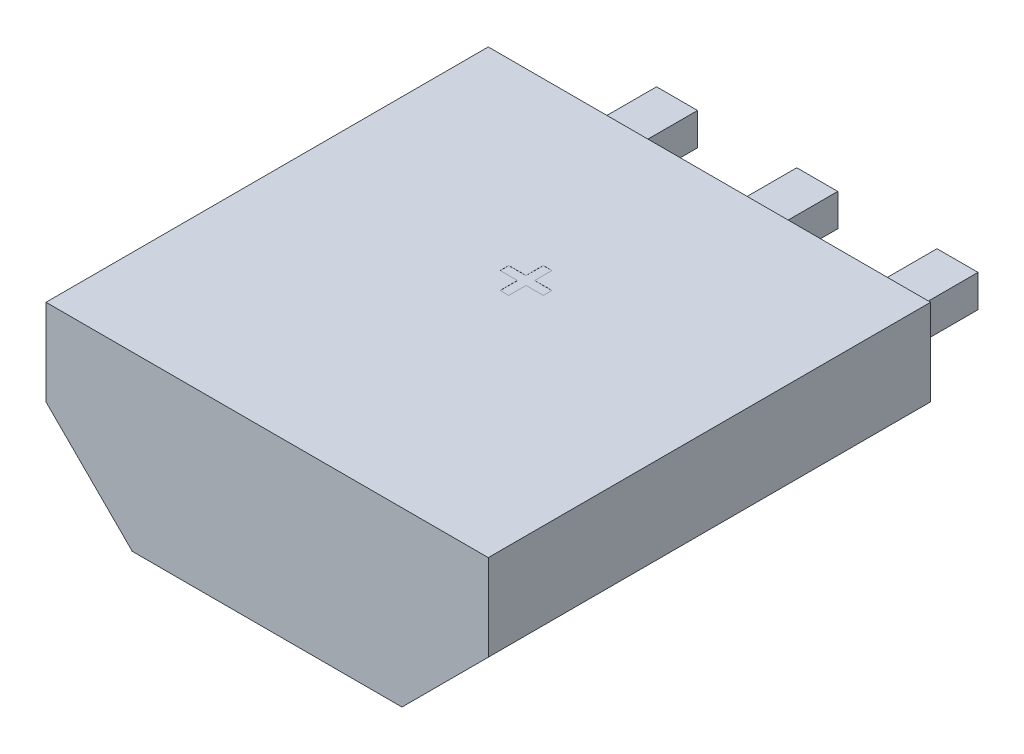
ISO-10303-21;
HEADER;
FILE_DESCRIPTION(('STEP AP214'),'2;1');
FILE_NAME('part.step','',(''),(''),'','','');
FILE_SCHEMA(('AUTOMOTIVE_DESIGN { 1 0 10303 214 1 1 1 1 }'));
ENDSEC;
DATA;
#1=APPLICATION_CONTEXT('core data for automotive mechanical design processes');
#2=APPLICATION_PROTOCOL_DEFINITION('international standard','automotive_design',2000,#1);
#3=PRODUCT_CONTEXT('',#1,'mechanical');
#4=PRODUCT('Part','Part','',(#3));
#5=PRODUCT_RELATED_PRODUCT_CATEGORY('part','',(#4));
#6=PRODUCT_DEFINITION_FORMATION('','',#4);
#7=PRODUCT_DEFINITION_CONTEXT('part definition',#1,'design');
#8=PRODUCT_DEFINITION('design','',#6,#7);
#9=PRODUCT_DEFINITION_SHAPE('','',#8);
#10=(LENGTH_UNIT() NAMED_UNIT(*) SI_UNIT(.MILLI.,.METRE.));
#11=(NAMED_UNIT(*) PLANE_ANGLE_UNIT() SI_UNIT($,.RADIAN.));
#12=(NAMED_UNIT(*) SI_UNIT($,.STERADIAN.) SOLID_ANGLE_UNIT());
#13=UNCERTAINTY_MEASURE_WITH_UNIT(LENGTH_MEASURE(1.E-05),#10,'distance_accuracy_value','');
#14=(GEOMETRIC_REPRESENTATION_CONTEXT(3) GLOBAL_UNCERTAINTY_ASSIGNED_CONTEXT((#13)) GLOBAL_UNIT_ASSIGNED_CONTEXT((#10,
#11,#12)) REPRESENTATION_CONTEXT('',''));
#15=CARTESIAN_POINT('',(0.,0.,0.));
#16=DIRECTION('',(0.,0.,1.));
#17=DIRECTION('',(1.,0.,0.));
#18=AXIS2_PLACEMENT_3D('',#15,#16,#17);
#19=CARTESIAN_POINT('',(-2.05,-1.6,0.));
#20=DIRECTION('',(0.,0.,1.));
#21=DIRECTION('',(1.,0.,0.));
#22=AXIS2_PLACEMENT_3D('',#19,#20,#21);
#23=PLANE('',#22);
#24=DIRECTION('',(0.,-1.,0.));
#25=VECTOR('',#24,1.);
#26=CARTESIAN_POINT('',(1.49,-0.84,0.));
#27=LINE('',#26,#25);
#28=CARTESIAN_POINT('',(1.49,-0.54,0.));
#29=VERTEX_POINT('',#28);
#30=CARTESIAN_POINT('',(1.49,-0.84,0.));
#31=VERTEX_POINT('',#30);
#32=EDGE_CURVE('E371',#29,#31,#27,.T.);
#33=ORIENTED_EDGE('',*,*,#32,.F.);
#34=DIRECTION('',(1.,0.,0.));
#35=VECTOR('',#34,1.);
#36=CARTESIAN_POINT('',(1.49,-0.54,0.));
#37=LINE('',#36,#35);
#38=CARTESIAN_POINT('',(1.11,-0.54,0.));
#39=VERTEX_POINT('',#38);
#40=EDGE_CURVE('E376',#39,#29,#37,.T.);
#41=ORIENTED_EDGE('',*,*,#40,.F.);
#42=DIRECTION('',(0.,1.,0.));
#43=VECTOR('',#42,1.);
#44=CARTESIAN_POINT('',(1.11,-0.54,0.));
#45=LINE('',#44,#43);
#46=CARTESIAN_POINT('',(1.11,-0.84,0.));
#47=VERTEX_POINT('',#46);
#48=EDGE_CURVE('E388',#47,#39,#45,.T.);
#49=ORIENTED_EDGE('',*,*,#48,.F.);
#50=DIRECTION('',(-1.,0.,0.));
#51=VECTOR('',#50,1.);
#52=CARTESIAN_POINT('',(1.11,-0.84,0.));
#53=LINE('',#52,#51);
#54=EDGE_CURVE('E385',#31,#47,#53,.T.);
#55=ORIENTED_EDGE('',*,*,#54,.F.);
#56=EDGE_LOOP('',(#33,#41,#49,#55));
#57=FACE_BOUND('',#56,.T.);
#58=DIRECTION('',(0.,-1.,0.));
#59=VECTOR('',#58,1.);
#60=CARTESIAN_POINT('',(-2.05,0.,0.));
#61=LINE('',#60,#59);
#62=CARTESIAN_POINT('',(-2.05,0.,0.));
#63=VERTEX_POINT('',#62);
#64=CARTESIAN_POINT('',(-2.05,-0.8,0.));
#65=VERTEX_POINT('',#64);
#66=EDGE_CURVE('E438',#63,#65,#61,.T.);
#67=ORIENTED_EDGE('',*,*,#66,.F.);
#68=DIRECTION('',(-1.,0.,0.));
#69=VECTOR('',#68,1.);
#70=CARTESIAN_POINT('',(2.05,0.,0.));
#71=LINE('',#70,#69);
#72=CARTESIAN_POINT('',(2.05,0.,0.));
#73=VERTEX_POINT('',#72);
#74=EDGE_CURVE('E454',#73,#63,#71,.T.);
#75=ORIENTED_EDGE('',*,*,#74,.F.);
#76=DIRECTION('',(0.,1.,0.));
#77=VECTOR('',#76,1.);
#78=CARTESIAN_POINT('',(2.05,-0.800000000000001,0.));
#79=LINE('',#78,#77);
#80=CARTESIAN_POINT('',(2.05,-0.800000000000001,0.));
#81=VERTEX_POINT('',#80);
#82=EDGE_CURVE('E451',#81,#73,#79,.T.);
#83=ORIENTED_EDGE('',*,*,#82,.F.);
#84=DIRECTION('',(0.707106781186547,0.707106781186548,0.));
#85=VECTOR('',#84,1.);
#86=CARTESIAN_POINT('',(1.25,-1.6,0.));
#87=LINE('',#86,#85);
#88=CARTESIAN_POINT('',(1.25,-1.6,0.));
#89=VERTEX_POINT('',#88);
#90=EDGE_CURVE('E448',#89,#81,#87,.T.);
#91=ORIENTED_EDGE('',*,*,#90,.F.);
#92=DIRECTION('',(1.,0.,0.));
#93=VECTOR('',#92,1.);
#94=CARTESIAN_POINT('',(-1.25,-1.6,0.));
#95=LINE('',#94,#93);
#96=CARTESIAN_POINT('',(-1.25,-1.6,0.));
#97=VERTEX_POINT('',#96);
#98=EDGE_CURVE('E445',#97,#89,#95,.T.);
#99=ORIENTED_EDGE('',*,*,#98,.F.);
#100=DIRECTION('',(0.707106781186548,-0.707106781186547,0.));
#101=VECTOR('',#100,1.);
#102=CARTESIAN_POINT('',(-2.05,-0.8,0.));
#103=LINE('',#102,#101);
#104=EDGE_CURVE('E441',#65,#97,#103,.T.);
#105=ORIENTED_EDGE('',*,*,#104,.F.);
#106=EDGE_LOOP('',(#67,#75,#83,#91,#99,#105));
#107=FACE_BOUND('',#106,.T.);
#108=DIRECTION('',(0.,-1.,0.));
#109=VECTOR('',#108,1.);
#110=CARTESIAN_POINT('',(0.19,-0.84,0.));
#111=LINE('',#110,#109);
#112=CARTESIAN_POINT('',(0.19,-0.54,0.));
#113=VERTEX_POINT('',#112);
#114=CARTESIAN_POINT('',(0.19,-0.84,0.));
#115=VERTEX_POINT('',#114);
#116=EDGE_CURVE('E404',#113,#115,#111,.T.);
#117=ORIENTED_EDGE('',*,*,#116,.F.);
#118=DIRECTION('',(1.,0.,0.));
#119=VECTOR('',#118,1.);
#120=CARTESIAN_POINT('',(0.19,-0.54,0.));
#121=LINE('',#120,#119);
#122=CARTESIAN_POINT('',(-0.19,-0.54,0.));
#123=VERTEX_POINT('',#122);
#124=EDGE_CURVE('E409',#123,#113,#121,.T.);
#125=ORIENTED_EDGE('',*,*,#124,.F.);
#126=DIRECTION('',(0.,1.,0.));
#127=VECTOR('',#126,1.);
#128=CARTESIAN_POINT('',(-0.19,-0.54,0.));
#129=LINE('',#128,#127);
#130=CARTESIAN_POINT('',(-0.19,-0.84,0.));
#131=VERTEX_POINT('',#130);
#132=EDGE_CURVE('E421',#131,#123,#129,.T.);
#133=ORIENTED_EDGE('',*,*,#132,.F.);
#134=DIRECTION('',(-1.,0.,0.));
#135=VECTOR('',#134,1.);
#136=CARTESIAN_POINT('',(-0.19,-0.84,0.));
#137=LINE('',#136,#135);
#138=EDGE_CURVE('E418',#115,#131,#137,.T.);
#139=ORIENTED_EDGE('',*,*,#138,.F.);
#140=EDGE_LOOP('',(#117,#125,#133,#139));
#141=FACE_BOUND('',#140,.T.);
#142=DIRECTION('',(0.,-1.,0.));
#143=VECTOR('',#142,1.);
#144=CARTESIAN_POINT('',(-1.11,-0.84,0.));
#145=LINE('',#144,#143);
#146=CARTESIAN_POINT('',(-1.11,-0.54,0.));
#147=VERTEX_POINT('',#146);
#148=CARTESIAN_POINT('',(-1.11,-0.84,0.));
#149=VERTEX_POINT('',#148);
#150=EDGE_CURVE('E339',#147,#149,#145,.T.);
#151=ORIENTED_EDGE('',*,*,#150,.F.);
#152=DIRECTION('',(1.,0.,0.));
#153=VECTOR('',#152,1.);
#154=CARTESIAN_POINT('',(-1.11,-0.54,0.));
#155=LINE('',#154,#153);
#156=CARTESIAN_POINT('',(-1.49,-0.54,0.));
#157=VERTEX_POINT('',#156);
#158=EDGE_CURVE('E346',#157,#147,#155,.T.);
#159=ORIENTED_EDGE('',*,*,#158,.F.);
#160=DIRECTION('',(0.,1.,0.));
#161=VECTOR('',#160,1.);
#162=CARTESIAN_POINT('',(-1.49,-0.54,0.));
#163=LINE('',#162,#161);
#164=CARTESIAN_POINT('',(-1.49,-0.84,0.));
#165=VERTEX_POINT('',#164);
#166=EDGE_CURVE('E356',#165,#157,#163,.T.);
#167=ORIENTED_EDGE('',*,*,#166,.F.);
#168=DIRECTION('',(-1.,0.,0.));
#169=VECTOR('',#168,1.);
#170=CARTESIAN_POINT('',(-1.49,-0.84,0.));
#171=LINE('',#170,#169);
#172=EDGE_CURVE('E60',#149,#165,#171,.T.);
#173=ORIENTED_EDGE('',*,*,#172,.F.);
#174=EDGE_LOOP('',(#151,#159,#167,#173));
#175=FACE_BOUND('',#174,.T.);
#176=ADVANCED_FACE('F35',(#57,#107,#141,#175),#23,.F.);
#177=CARTESIAN_POINT('',(-2.05,0.,0.));
#178=DIRECTION('',(-1.,0.,0.));
#179=DIRECTION('',(0.,-1.,0.));
#180=AXIS2_PLACEMENT_3D('',#177,#178,#179);
#181=PLANE('',#180);
#182=DIRECTION('',(0.,-1.,0.));
#183=VECTOR('',#182,1.);
#184=CARTESIAN_POINT('',(-2.05,0.,4.1));
#185=LINE('',#184,#183);
#186=CARTESIAN_POINT('',(-2.05,0.,4.1));
#187=VERTEX_POINT('',#186);
#188=CARTESIAN_POINT('',(-2.05,-0.8,4.1));
#189=VERTEX_POINT('',#188);
#190=EDGE_CURVE('E437',#187,#189,#185,.T.);
#191=ORIENTED_EDGE('',*,*,#190,.F.);
#192=DIRECTION('',(0.,0.,1.));
#193=VECTOR('',#192,1.);
#194=CARTESIAN_POINT('',(-2.05,0.,0.));
#195=LINE('',#194,#193);
#196=EDGE_CURVE('E11',#63,#187,#195,.T.);
#197=ORIENTED_EDGE('',*,*,#196,.F.);
#198=ORIENTED_EDGE('',*,*,#66,.T.);
#199=DIRECTION('',(0.,0.,1.));
#200=VECTOR('',#199,1.);
#201=CARTESIAN_POINT('',(-2.05,-0.8,0.));
#202=LINE('',#201,#200);
#203=EDGE_CURVE('E39',#65,#189,#202,.T.);
#204=ORIENTED_EDGE('',*,*,#203,.T.);
#205=EDGE_LOOP('',(#191,#197,#198,#204));
#206=FACE_BOUND('',#205,.T.);
#207=ADVANCED_FACE('F37',(#206),#181,.T.);
#208=CARTESIAN_POINT('',(2.05,0.,0.));
#209=DIRECTION('',(0.,1.,0.));
#210=DIRECTION('',(0.,0.,1.));
#211=AXIS2_PLACEMENT_3D('',#208,#209,#210);
#212=PLANE('',#211);
#213=DIRECTION('',(0.,0.,1.));
#214=VECTOR('',#213,1.);
#215=CARTESIAN_POINT('',(-0.2,0.,1.66));
#216=LINE('',#215,#214);
#217=CARTESIAN_POINT('',(-0.2,0.,1.66));
#218=VERTEX_POINT('',#217);
#219=CARTESIAN_POINT('',(-0.2,0.,1.74));
#220=VERTEX_POINT('',#219);
#221=EDGE_CURVE('E52',#218,#220,#216,.T.);
#222=ORIENTED_EDGE('',*,*,#221,.F.);
#223=DIRECTION('',(-1.,0.,0.));
#224=VECTOR('',#223,1.);
#225=CARTESIAN_POINT('',(-0.2,0.,1.66));
#226=LINE('',#225,#224);
#227=CARTESIAN_POINT('',(-0.0399999999999998,0.,1.66));
#228=VERTEX_POINT('',#227);
#229=EDGE_CURVE('E254',#228,#218,#226,.T.);
#230=ORIENTED_EDGE('',*,*,#229,.F.);
#231=DIRECTION('',(0.,0.,1.));
#232=VECTOR('',#231,1.);
#233=CARTESIAN_POINT('',(-0.0399999999999998,0.,1.5));
#234=LINE('',#233,#232);
#235=CARTESIAN_POINT('',(-0.0399999999999998,0.,1.5));
#236=VERTEX_POINT('',#235);
#237=EDGE_CURVE('E257',#236,#228,#234,.T.);
#238=ORIENTED_EDGE('',*,*,#237,.F.);
#239=DIRECTION('',(-1.,0.,0.));
#240=VECTOR('',#239,1.);
#241=CARTESIAN_POINT('',(-0.0399999999999998,0.,1.5));
#242=LINE('',#241,#240);
#243=CARTESIAN_POINT('',(0.0400000000000002,0.,1.5));
#244=VERTEX_POINT('',#243);
#245=EDGE_CURVE('E309',#244,#236,#242,.T.);
#246=ORIENTED_EDGE('',*,*,#245,.F.);
#247=DIRECTION('',(0.,0.,-1.));
#248=VECTOR('',#247,1.);
#249=CARTESIAN_POINT('',(0.0400000000000002,0.,1.5));
#250=LINE('',#249,#248);
#251=CARTESIAN_POINT('',(0.0400000000000002,0.,1.66));
#252=VERTEX_POINT('',#251);
#253=EDGE_CURVE('E306',#252,#244,#250,.T.);
#254=ORIENTED_EDGE('',*,*,#253,.F.);
#255=DIRECTION('',(-1.,0.,0.));
#256=VECTOR('',#255,1.);
#257=CARTESIAN_POINT('',(0.2,0.,1.66));
#258=LINE('',#257,#256);
#259=CARTESIAN_POINT('',(0.2,0.,1.66));
#260=VERTEX_POINT('',#259);
#261=EDGE_CURVE('E303',#260,#252,#258,.T.);
#262=ORIENTED_EDGE('',*,*,#261,.F.);
#263=DIRECTION('',(0.,0.,-1.));
#264=VECTOR('',#263,1.);
#265=CARTESIAN_POINT('',(0.2,0.,1.66));
#266=LINE('',#265,#264);
#267=CARTESIAN_POINT('',(0.2,0.,1.74));
#268=VERTEX_POINT('',#267);
#269=EDGE_CURVE('E300',#268,#260,#266,.T.);
#270=ORIENTED_EDGE('',*,*,#269,.F.);
#271=DIRECTION('',(1.,0.,0.));
#272=VECTOR('',#271,1.);
#273=CARTESIAN_POINT('',(0.2,0.,1.74));
#274=LINE('',#273,#272);
#275=CARTESIAN_POINT('',(0.0400000000000002,0.,1.74));
#276=VERTEX_POINT('',#275);
#277=EDGE_CURVE('E297',#276,#268,#274,.T.);
#278=ORIENTED_EDGE('',*,*,#277,.F.);
#279=DIRECTION('',(0.,0.,-1.));
#280=VECTOR('',#279,1.);
#281=CARTESIAN_POINT('',(0.0400000000000002,0.,1.9));
#282=LINE('',#281,#280);
#283=CARTESIAN_POINT('',(0.0400000000000002,0.,1.9));
#284=VERTEX_POINT('',#283);
#285=EDGE_CURVE('E294',#284,#276,#282,.T.);
#286=ORIENTED_EDGE('',*,*,#285,.F.);
#287=DIRECTION('',(1.,0.,0.));
#288=VECTOR('',#287,1.);
#289=CARTESIAN_POINT('',(-0.0399999999999997,0.,1.9));
#290=LINE('',#289,#288);
#291=CARTESIAN_POINT('',(-0.0399999999999997,0.,1.9));
#292=VERTEX_POINT('',#291);
#293=EDGE_CURVE('E291',#292,#284,#290,.T.);
#294=ORIENTED_EDGE('',*,*,#293,.F.);
#295=DIRECTION('',(0.,0.,1.));
#296=VECTOR('',#295,1.);
#297=CARTESIAN_POINT('',(-0.0399999999999997,0.,1.9));
#298=LINE('',#297,#296);
#299=CARTESIAN_POINT('',(-0.0399999999999998,0.,1.74));
#300=VERTEX_POINT('',#299);
#301=EDGE_CURVE('E288',#300,#292,#298,.T.);
#302=ORIENTED_EDGE('',*,*,#301,.F.);
#303=DIRECTION('',(1.,0.,0.));
#304=VECTOR('',#303,1.);
#305=CARTESIAN_POINT('',(-0.2,0.,1.74));
#306=LINE('',#305,#304);
#307=EDGE_CURVE('E286',#220,#300,#306,.T.);
#308=ORIENTED_EDGE('',*,*,#307,.F.);
#309=EDGE_LOOP('',(#222,#230,#238,#246,#254,#262,#270,#278,#286,#294,#302,#308));
#310=FACE_BOUND('',#309,.T.);
#311=DIRECTION('',(-1.,0.,0.));
#312=VECTOR('',#311,1.);
#313=CARTESIAN_POINT('',(2.05,0.,4.1));
#314=LINE('',#313,#312);
#315=CARTESIAN_POINT('',(2.05,0.,4.1));
#316=VERTEX_POINT('',#315);
#317=EDGE_CURVE('E442',#316,#187,#314,.T.);
#318=ORIENTED_EDGE('',*,*,#317,.F.);
#319=DIRECTION('',(0.,0.,1.));
#320=VECTOR('',#319,1.);
#321=CARTESIAN_POINT('',(2.05,0.,0.));
#322=LINE('',#321,#320);
#323=EDGE_CURVE('E44',#73,#316,#322,.T.);
#324=ORIENTED_EDGE('',*,*,#323,.F.);
#325=ORIENTED_EDGE('',*,*,#74,.T.);
#326=ORIENTED_EDGE('',*,*,#196,.T.);
#327=EDGE_LOOP('',(#318,#324,#325,#326));
#328=FACE_BOUND('',#327,.T.);
#329=ADVANCED_FACE('F491',(#310,#328),#212,.T.);
#330=CARTESIAN_POINT('',(2.05,-0.800000000000001,0.));
#331=DIRECTION('',(1.,0.,0.));
#332=DIRECTION('',(0.,1.,0.));
#333=AXIS2_PLACEMENT_3D('',#330,#331,#332);
#334=PLANE('',#333);
#335=DIRECTION('',(0.,1.,0.));
#336=VECTOR('',#335,1.);
#337=CARTESIAN_POINT('',(2.05,-0.800000000000001,4.1));
#338=LINE('',#337,#336);
#339=CARTESIAN_POINT('',(2.05,-0.800000000000001,4.1));
#340=VERTEX_POINT('',#339);
#341=EDGE_CURVE('E468',#340,#316,#338,.T.);
#342=ORIENTED_EDGE('',*,*,#341,.F.);
#343=DIRECTION('',(0.,0.,1.));
#344=VECTOR('',#343,1.);
#345=CARTESIAN_POINT('',(2.05,-0.800000000000001,0.));
#346=LINE('',#345,#344);
#347=EDGE_CURVE('E474',#81,#340,#346,.T.);
#348=ORIENTED_EDGE('',*,*,#347,.F.);
#349=ORIENTED_EDGE('',*,*,#82,.T.);
#350=ORIENTED_EDGE('',*,*,#323,.T.);
#351=EDGE_LOOP('',(#342,#348,#349,#350));
#352=FACE_BOUND('',#351,.T.);
#353=ADVANCED_FACE('F504',(#352),#334,.T.);
#354=CARTESIAN_POINT('',(1.25,-1.6,0.));
#355=DIRECTION('',(0.707106781186548,-0.707106781186547,0.));
#356=DIRECTION('',(0.707106781186547,0.707106781186548,0.));
#357=AXIS2_PLACEMENT_3D('',#354,#355,#356);
#358=PLANE('',#357);
#359=DIRECTION('',(0.707106781186547,0.707106781186548,0.));
#360=VECTOR('',#359,1.);
#361=CARTESIAN_POINT('',(1.25,-1.6,4.1));
#362=LINE('',#361,#360);
#363=CARTESIAN_POINT('',(1.25,-1.6,4.1));
#364=VERTEX_POINT('',#363);
#365=EDGE_CURVE('E465',#364,#340,#362,.T.);
#366=ORIENTED_EDGE('',*,*,#365,.F.);
#367=DIRECTION('',(0.,0.,1.));
#368=VECTOR('',#367,1.);
#369=CARTESIAN_POINT('',(1.25,-1.6,0.));
#370=LINE('',#369,#368);
#371=EDGE_CURVE('E476',#89,#364,#370,.T.);
#372=ORIENTED_EDGE('',*,*,#371,.F.);
#373=ORIENTED_EDGE('',*,*,#90,.T.);
#374=ORIENTED_EDGE('',*,*,#347,.T.);
#375=EDGE_LOOP('',(#366,#372,#373,#374));
#376=FACE_BOUND('',#375,.T.);
#377=ADVANCED_FACE('F502',(#376),#358,.T.);
#378=CARTESIAN_POINT('',(-1.25,-1.6,0.));
#379=DIRECTION('',(0.,-1.,0.));
#380=DIRECTION('',(1.,0.,0.));
#381=AXIS2_PLACEMENT_3D('',#378,#379,#380);
#382=PLANE('',#381);
#383=CARTESIAN_POINT('',(0.,-1.6,1.7));
#384=DIRECTION('',(0.,-1.,0.));
#385=DIRECTION('',(1.,0.,0.));
#386=AXIS2_PLACEMENT_3D('',#383,#384,#385);
#387=CIRCLE('',#386,0.2);
#388=CARTESIAN_POINT('',(0.2,-1.6,1.7));
#389=VERTEX_POINT('',#388);
#390=EDGE_CURVE('E316',#389,#389,#387,.T.);
#391=ORIENTED_EDGE('',*,*,#390,.F.);
#392=EDGE_LOOP('',(#391));
#393=FACE_BOUND('',#392,.T.);
#394=DIRECTION('',(1.,0.,0.));
#395=VECTOR('',#394,1.);
#396=CARTESIAN_POINT('',(-1.25,-1.6,4.1));
#397=LINE('',#396,#395);
#398=CARTESIAN_POINT('',(-1.25,-1.6,4.1));
#399=VERTEX_POINT('',#398);
#400=EDGE_CURVE('E462',#399,#364,#397,.T.);
#401=ORIENTED_EDGE('',*,*,#400,.F.);
#402=DIRECTION('',(0.,0.,1.));
#403=VECTOR('',#402,1.);
#404=CARTESIAN_POINT('',(-1.25,-1.6,0.));
#405=LINE('',#404,#403);
#406=EDGE_CURVE('E477',#97,#399,#405,.T.);
#407=ORIENTED_EDGE('',*,*,#406,.F.);
#408=ORIENTED_EDGE('',*,*,#98,.T.);
#409=ORIENTED_EDGE('',*,*,#371,.T.);
#410=EDGE_LOOP('',(#401,#407,#408,#409));
#411=FACE_BOUND('',#410,.T.);
#412=ADVANCED_FACE('F499',(#393,#411),#382,.T.);
#413=CARTESIAN_POINT('',(-2.05,-0.8,0.));
#414=DIRECTION('',(-0.707106781186547,-0.707106781186548,0.));
#415=DIRECTION('',(0.707106781186548,-0.707106781186547,0.));
#416=AXIS2_PLACEMENT_3D('',#413,#414,#415);
#417=PLANE('',#416);
#418=DIRECTION('',(0.707106781186548,-0.707106781186547,0.));
#419=VECTOR('',#418,1.);
#420=CARTESIAN_POINT('',(-2.05,-0.8,4.1));
#421=LINE('',#420,#419);
#422=EDGE_CURVE('E459',#189,#399,#421,.T.);
#423=ORIENTED_EDGE('',*,*,#422,.F.);
#424=ORIENTED_EDGE('',*,*,#203,.F.);
#425=ORIENTED_EDGE('',*,*,#104,.T.);
#426=ORIENTED_EDGE('',*,*,#406,.T.);
#427=EDGE_LOOP('',(#423,#424,#425,#426));
#428=FACE_BOUND('',#427,.T.);
#429=ADVANCED_FACE('F485',(#428),#417,.T.);
#430=CARTESIAN_POINT('',(-2.05,-1.6,4.1));
#431=DIRECTION('',(0.,0.,1.));
#432=DIRECTION('',(1.,0.,0.));
#433=AXIS2_PLACEMENT_3D('',#430,#431,#432);
#434=PLANE('',#433);
#435=ORIENTED_EDGE('',*,*,#190,.T.);
#436=ORIENTED_EDGE('',*,*,#422,.T.);
#437=ORIENTED_EDGE('',*,*,#400,.T.);
#438=ORIENTED_EDGE('',*,*,#365,.T.);
#439=ORIENTED_EDGE('',*,*,#341,.T.);
#440=ORIENTED_EDGE('',*,*,#317,.T.);
#441=EDGE_LOOP('',(#435,#436,#437,#438,#439,#440));
#442=FACE_BOUND('',#441,.T.);
#443=ADVANCED_FACE('F487',(#442),#434,.T.);
#444=CARTESIAN_POINT('',(0.19,-0.84,-1.));
#445=DIRECTION('',(-1.,0.,0.));
#446=DIRECTION('',(0.,-1.,0.));
#447=AXIS2_PLACEMENT_3D('',#444,#445,#446);
#448=PLANE('',#447);
#449=ORIENTED_EDGE('',*,*,#116,.T.);
#450=DIRECTION('',(0.,0.,1.));
#451=VECTOR('',#450,1.);
#452=CARTESIAN_POINT('',(0.19,-0.84,-1.));
#453=LINE('',#452,#451);
#454=CARTESIAN_POINT('',(0.19,-0.84,-1.));
#455=VERTEX_POINT('',#454);
#456=EDGE_CURVE('E434',#455,#115,#453,.T.);
#457=ORIENTED_EDGE('',*,*,#456,.F.);
#458=DIRECTION('',(0.,-1.,0.));
#459=VECTOR('',#458,1.);
#460=CARTESIAN_POINT('',(0.19,-0.84,-1.));
#461=LINE('',#460,#459);
#462=CARTESIAN_POINT('',(0.19,-0.54,-1.));
#463=VERTEX_POINT('',#462);
#464=EDGE_CURVE('E405',#463,#455,#461,.T.);
#465=ORIENTED_EDGE('',*,*,#464,.F.);
#466=DIRECTION('',(0.,0.,1.));
#467=VECTOR('',#466,1.);
#468=CARTESIAN_POINT('',(0.19,-0.54,-1.));
#469=LINE('',#468,#467);
#470=EDGE_CURVE('E415',#463,#113,#469,.T.);
#471=ORIENTED_EDGE('',*,*,#470,.T.);
#472=EDGE_LOOP('',(#449,#457,#465,#471));
#473=FACE_BOUND('',#472,.T.);
#474=ADVANCED_FACE('F522',(#473),#448,.F.);
#475=CARTESIAN_POINT('',(-0.19,-0.84,-1.));
#476=DIRECTION('',(0.,1.,0.));
#477=DIRECTION('',(0.,0.,1.));
#478=AXIS2_PLACEMENT_3D('',#475,#476,#477);
#479=PLANE('',#478);
#480=ORIENTED_EDGE('',*,*,#138,.T.);
#481=DIRECTION('',(0.,0.,1.));
#482=VECTOR('',#481,1.);
#483=CARTESIAN_POINT('',(-0.19,-0.84,-1.));
#484=LINE('',#483,#482);
#485=CARTESIAN_POINT('',(-0.19,-0.84,-1.));
#486=VERTEX_POINT('',#485);
#487=EDGE_CURVE('E431',#486,#131,#484,.T.);
#488=ORIENTED_EDGE('',*,*,#487,.F.);
#489=DIRECTION('',(-1.,0.,0.));
#490=VECTOR('',#489,1.);
#491=CARTESIAN_POINT('',(-0.19,-0.84,-1.));
#492=LINE('',#491,#490);
#493=EDGE_CURVE('E408',#455,#486,#492,.T.);
#494=ORIENTED_EDGE('',*,*,#493,.F.);
#495=ORIENTED_EDGE('',*,*,#456,.T.);
#496=EDGE_LOOP('',(#480,#488,#494,#495));
#497=FACE_BOUND('',#496,.T.);
#498=ADVANCED_FACE('F529',(#497),#479,.F.);
#499=CARTESIAN_POINT('',(-0.19,-0.54,-1.));
#500=DIRECTION('',(1.,0.,0.));
#501=DIRECTION('',(0.,0.,-1.));
#502=AXIS2_PLACEMENT_3D('',#499,#500,#501);
#503=PLANE('',#502);
#504=ORIENTED_EDGE('',*,*,#132,.T.);
#505=DIRECTION('',(0.,0.,1.));
#506=VECTOR('',#505,1.);
#507=CARTESIAN_POINT('',(-0.19,-0.54,-1.));
#508=LINE('',#507,#506);
#509=CARTESIAN_POINT('',(-0.19,-0.54,-1.));
#510=VERTEX_POINT('',#509);
#511=EDGE_CURVE('E428',#510,#123,#508,.T.);
#512=ORIENTED_EDGE('',*,*,#511,.F.);
#513=DIRECTION('',(0.,1.,0.));
#514=VECTOR('',#513,1.);
#515=CARTESIAN_POINT('',(-0.19,-0.54,-1.));
#516=LINE('',#515,#514);
#517=EDGE_CURVE('E411',#486,#510,#516,.T.);
#518=ORIENTED_EDGE('',*,*,#517,.F.);
#519=ORIENTED_EDGE('',*,*,#487,.T.);
#520=EDGE_LOOP('',(#504,#512,#518,#519));
#521=FACE_BOUND('',#520,.T.);
#522=ADVANCED_FACE('F600',(#521),#503,.F.);
#523=CARTESIAN_POINT('',(0.19,-0.54,-1.));
#524=DIRECTION('',(0.,-1.,0.));
#525=DIRECTION('',(0.,0.,-1.));
#526=AXIS2_PLACEMENT_3D('',#523,#524,#525);
#527=PLANE('',#526);
#528=ORIENTED_EDGE('',*,*,#124,.T.);
#529=ORIENTED_EDGE('',*,*,#470,.F.);
#530=DIRECTION('',(1.,0.,0.));
#531=VECTOR('',#530,1.);
#532=CARTESIAN_POINT('',(0.19,-0.54,-1.));
#533=LINE('',#532,#531);
#534=EDGE_CURVE('E413',#510,#463,#533,.T.);
#535=ORIENTED_EDGE('',*,*,#534,.F.);
#536=ORIENTED_EDGE('',*,*,#511,.T.);
#537=EDGE_LOOP('',(#528,#529,#535,#536));
#538=FACE_BOUND('',#537,.T.);
#539=ADVANCED_FACE('F596',(#538),#527,.F.);
#540=CARTESIAN_POINT('',(0.19,-0.54,-1.));
#541=DIRECTION('',(0.,0.,1.));
#542=DIRECTION('',(1.,0.,0.));
#543=AXIS2_PLACEMENT_3D('',#540,#541,#542);
#544=PLANE('',#543);
#545=ORIENTED_EDGE('',*,*,#464,.T.);
#546=ORIENTED_EDGE('',*,*,#493,.T.);
#547=ORIENTED_EDGE('',*,*,#517,.T.);
#548=ORIENTED_EDGE('',*,*,#534,.T.);
#549=EDGE_LOOP('',(#545,#546,#547,#548));
#550=FACE_BOUND('',#549,.T.);
#551=ADVANCED_FACE('F592',(#550),#544,.F.);
#552=CARTESIAN_POINT('',(1.49,-0.84,-1.));
#553=DIRECTION('',(-1.,0.,0.));
#554=DIRECTION('',(0.,-1.,0.));
#555=AXIS2_PLACEMENT_3D('',#552,#553,#554);
#556=PLANE('',#555);
#557=ORIENTED_EDGE('',*,*,#32,.T.);
#558=DIRECTION('',(0.,0.,1.));
#559=VECTOR('',#558,1.);
#560=CARTESIAN_POINT('',(1.49,-0.84,-1.));
#561=LINE('',#560,#559);
#562=CARTESIAN_POINT('',(1.49,-0.84,-1.));
#563=VERTEX_POINT('',#562);
#564=EDGE_CURVE('E401',#563,#31,#561,.T.);
#565=ORIENTED_EDGE('',*,*,#564,.F.);
#566=DIRECTION('',(0.,-1.,0.));
#567=VECTOR('',#566,1.);
#568=CARTESIAN_POINT('',(1.49,-0.84,-1.));
#569=LINE('',#568,#567);
#570=CARTESIAN_POINT('',(1.49,-0.54,-1.));
#571=VERTEX_POINT('',#570);
#572=EDGE_CURVE('E372',#571,#563,#569,.T.);
#573=ORIENTED_EDGE('',*,*,#572,.F.);
#574=DIRECTION('',(0.,0.,1.));
#575=VECTOR('',#574,1.);
#576=CARTESIAN_POINT('',(1.49,-0.54,-1.));
#577=LINE('',#576,#575);
#578=EDGE_CURVE('E382',#571,#29,#577,.T.);
#579=ORIENTED_EDGE('',*,*,#578,.T.);
#580=EDGE_LOOP('',(#557,#565,#573,#579));
#581=FACE_BOUND('',#580,.T.);
#582=ADVANCED_FACE('F588',(#581),#556,.F.);
#583=CARTESIAN_POINT('',(1.11,-0.84,-1.));
#584=DIRECTION('',(0.,1.,0.));
#585=DIRECTION('',(0.,0.,1.));
#586=AXIS2_PLACEMENT_3D('',#583,#584,#585);
#587=PLANE('',#586);
#588=ORIENTED_EDGE('',*,*,#54,.T.);
#589=DIRECTION('',(0.,0.,1.));
#590=VECTOR('',#589,1.);
#591=CARTESIAN_POINT('',(1.11,-0.84,-1.));
#592=LINE('',#591,#590);
#593=CARTESIAN_POINT('',(1.11,-0.84,-1.));
#594=VERTEX_POINT('',#593);
#595=EDGE_CURVE('E398',#594,#47,#592,.T.);
#596=ORIENTED_EDGE('',*,*,#595,.F.);
#597=DIRECTION('',(-1.,0.,0.));
#598=VECTOR('',#597,1.);
#599=CARTESIAN_POINT('',(1.11,-0.84,-1.));
#600=LINE('',#599,#598);
#601=EDGE_CURVE('E375',#563,#594,#600,.T.);
#602=ORIENTED_EDGE('',*,*,#601,.F.);
#603=ORIENTED_EDGE('',*,*,#564,.T.);
#604=EDGE_LOOP('',(#588,#596,#602,#603));
#605=FACE_BOUND('',#604,.T.);
#606=ADVANCED_FACE('F584',(#605),#587,.F.);
#607=CARTESIAN_POINT('',(1.11,-0.54,-1.));
#608=DIRECTION('',(1.,0.,0.));
#609=DIRECTION('',(0.,0.,-1.));
#610=AXIS2_PLACEMENT_3D('',#607,#608,#609);
#611=PLANE('',#610);
#612=ORIENTED_EDGE('',*,*,#48,.T.);
#613=DIRECTION('',(0.,0.,1.));
#614=VECTOR('',#613,1.);
#615=CARTESIAN_POINT('',(1.11,-0.54,-1.));
#616=LINE('',#615,#614);
#617=CARTESIAN_POINT('',(1.11,-0.54,-1.));
#618=VERTEX_POINT('',#617);
#619=EDGE_CURVE('E395',#618,#39,#616,.T.);
#620=ORIENTED_EDGE('',*,*,#619,.F.);
#621=DIRECTION('',(0.,1.,0.));
#622=VECTOR('',#621,1.);
#623=CARTESIAN_POINT('',(1.11,-0.54,-1.));
#624=LINE('',#623,#622);
#625=EDGE_CURVE('E378',#594,#618,#624,.T.);
#626=ORIENTED_EDGE('',*,*,#625,.F.);
#627=ORIENTED_EDGE('',*,*,#595,.T.);
#628=EDGE_LOOP('',(#612,#620,#626,#627));
#629=FACE_BOUND('',#628,.T.);
#630=ADVANCED_FACE('F580',(#629),#611,.F.);
#631=CARTESIAN_POINT('',(1.49,-0.54,-1.));
#632=DIRECTION('',(0.,-1.,0.));
#633=DIRECTION('',(0.,0.,-1.));
#634=AXIS2_PLACEMENT_3D('',#631,#632,#633);
#635=PLANE('',#634);
#636=ORIENTED_EDGE('',*,*,#40,.T.);
#637=ORIENTED_EDGE('',*,*,#578,.F.);
#638=DIRECTION('',(1.,0.,0.));
#639=VECTOR('',#638,1.);
#640=CARTESIAN_POINT('',(1.49,-0.54,-1.));
#641=LINE('',#640,#639);
#642=EDGE_CURVE('E380',#618,#571,#641,.T.);
#643=ORIENTED_EDGE('',*,*,#642,.F.);
#644=ORIENTED_EDGE('',*,*,#619,.T.);
#645=EDGE_LOOP('',(#636,#637,#643,#644));
#646=FACE_BOUND('',#645,.T.);
#647=ADVANCED_FACE('F576',(#646),#635,.F.);
#648=CARTESIAN_POINT('',(1.49,-0.54,-1.));
#649=DIRECTION('',(0.,0.,1.));
#650=DIRECTION('',(1.,0.,0.));
#651=AXIS2_PLACEMENT_3D('',#648,#649,#650);
#652=PLANE('',#651);
#653=ORIENTED_EDGE('',*,*,#572,.T.);
#654=ORIENTED_EDGE('',*,*,#601,.T.);
#655=ORIENTED_EDGE('',*,*,#625,.T.);
#656=ORIENTED_EDGE('',*,*,#642,.T.);
#657=EDGE_LOOP('',(#653,#654,#655,#656));
#658=FACE_BOUND('',#657,.T.);
#659=ADVANCED_FACE('F572',(#658),#652,.F.);
#660=CARTESIAN_POINT('',(-1.11,-0.84,-1.));
#661=DIRECTION('',(-1.,0.,0.));
#662=DIRECTION('',(0.,0.,1.));
#663=AXIS2_PLACEMENT_3D('',#660,#661,#662);
#664=PLANE('',#663);
#665=ORIENTED_EDGE('',*,*,#150,.T.);
#666=DIRECTION('',(0.,0.,1.));
#667=VECTOR('',#666,1.);
#668=CARTESIAN_POINT('',(-1.11,-0.84,-1.));
#669=LINE('',#668,#667);
#670=CARTESIAN_POINT('',(-1.11,-0.84,-1.));
#671=VERTEX_POINT('',#670);
#672=EDGE_CURVE('E369',#671,#149,#669,.T.);
#673=ORIENTED_EDGE('',*,*,#672,.F.);
#674=DIRECTION('',(0.,-1.,0.));
#675=VECTOR('',#674,1.);
#676=CARTESIAN_POINT('',(-1.11,-0.84,-1.));
#677=LINE('',#676,#675);
#678=CARTESIAN_POINT('',(-1.11,-0.54,-1.));
#679=VERTEX_POINT('',#678);
#680=EDGE_CURVE('E342',#679,#671,#677,.T.);
#681=ORIENTED_EDGE('',*,*,#680,.F.);
#682=DIRECTION('',(0.,0.,1.));
#683=VECTOR('',#682,1.);
#684=CARTESIAN_POINT('',(-1.11,-0.54,-1.));
#685=LINE('',#684,#683);
#686=EDGE_CURVE('E352',#679,#147,#685,.T.);
#687=ORIENTED_EDGE('',*,*,#686,.T.);
#688=EDGE_LOOP('',(#665,#673,#681,#687));
#689=FACE_BOUND('',#688,.T.);
#690=ADVANCED_FACE('F568',(#689),#664,.F.);
#691=CARTESIAN_POINT('',(-1.49,-0.84,-1.));
#692=DIRECTION('',(0.,1.,0.));
#693=DIRECTION('',(0.,0.,1.));
#694=AXIS2_PLACEMENT_3D('',#691,#692,#693);
#695=PLANE('',#694);
#696=ORIENTED_EDGE('',*,*,#172,.T.);
#697=DIRECTION('',(0.,0.,1.));
#698=VECTOR('',#697,1.);
#699=CARTESIAN_POINT('',(-1.49,-0.84,-1.));
#700=LINE('',#699,#698);
#701=CARTESIAN_POINT('',(-1.49,-0.84,-1.));
#702=VERTEX_POINT('',#701);
#703=EDGE_CURVE('E366',#702,#165,#700,.T.);
#704=ORIENTED_EDGE('',*,*,#703,.F.);
#705=DIRECTION('',(-1.,0.,0.));
#706=VECTOR('',#705,1.);
#707=CARTESIAN_POINT('',(-1.49,-0.84,-1.));
#708=LINE('',#707,#706);
#709=EDGE_CURVE('E345',#671,#702,#708,.T.);
#710=ORIENTED_EDGE('',*,*,#709,.F.);
#711=ORIENTED_EDGE('',*,*,#672,.T.);
#712=EDGE_LOOP('',(#696,#704,#710,#711));
#713=FACE_BOUND('',#712,.T.);
#714=ADVANCED_FACE('F564',(#713),#695,.F.);
#715=CARTESIAN_POINT('',(-1.49,-0.54,-1.));
#716=DIRECTION('',(1.,0.,0.));
#717=DIRECTION('',(0.,0.,-1.));
#718=AXIS2_PLACEMENT_3D('',#715,#716,#717);
#719=PLANE('',#718);
#720=ORIENTED_EDGE('',*,*,#166,.T.);
#721=DIRECTION('',(0.,0.,1.));
#722=VECTOR('',#721,1.);
#723=CARTESIAN_POINT('',(-1.49,-0.54,-1.));
#724=LINE('',#723,#722);
#725=CARTESIAN_POINT('',(-1.49,-0.54,-1.));
#726=VERTEX_POINT('',#725);
#727=EDGE_CURVE('E363',#726,#157,#724,.T.);
#728=ORIENTED_EDGE('',*,*,#727,.F.);
#729=DIRECTION('',(0.,1.,0.));
#730=VECTOR('',#729,1.);
#731=CARTESIAN_POINT('',(-1.49,-0.54,-1.));
#732=LINE('',#731,#730);
#733=EDGE_CURVE('E348',#702,#726,#732,.T.);
#734=ORIENTED_EDGE('',*,*,#733,.F.);
#735=ORIENTED_EDGE('',*,*,#703,.T.);
#736=EDGE_LOOP('',(#720,#728,#734,#735));
#737=FACE_BOUND('',#736,.T.);
#738=ADVANCED_FACE('F560',(#737),#719,.F.);
#739=CARTESIAN_POINT('',(-1.11,-0.54,-1.));
#740=DIRECTION('',(0.,-1.,0.));
#741=DIRECTION('',(0.,0.,-1.));
#742=AXIS2_PLACEMENT_3D('',#739,#740,#741);
#743=PLANE('',#742);
#744=ORIENTED_EDGE('',*,*,#158,.T.);
#745=ORIENTED_EDGE('',*,*,#686,.F.);
#746=DIRECTION('',(1.,0.,0.));
#747=VECTOR('',#746,1.);
#748=CARTESIAN_POINT('',(-1.11,-0.54,-1.));
#749=LINE('',#748,#747);
#750=EDGE_CURVE('E350',#726,#679,#749,.T.);
#751=ORIENTED_EDGE('',*,*,#750,.F.);
#752=ORIENTED_EDGE('',*,*,#727,.T.);
#753=EDGE_LOOP('',(#744,#745,#751,#752));
#754=FACE_BOUND('',#753,.T.);
#755=ADVANCED_FACE('F552',(#754),#743,.F.);
#756=CARTESIAN_POINT('',(-1.11,-0.54,-1.));
#757=DIRECTION('',(0.,0.,1.));
#758=DIRECTION('',(1.,0.,0.));
#759=AXIS2_PLACEMENT_3D('',#756,#757,#758);
#760=PLANE('',#759);
#761=ORIENTED_EDGE('',*,*,#680,.T.);
#762=ORIENTED_EDGE('',*,*,#709,.T.);
#763=ORIENTED_EDGE('',*,*,#733,.T.);
#764=ORIENTED_EDGE('',*,*,#750,.T.);
#765=EDGE_LOOP('',(#761,#762,#763,#764));
#766=FACE_BOUND('',#765,.T.);
#767=ADVANCED_FACE('F543',(#766),#760,.F.);
#768=CARTESIAN_POINT('',(0.,-1.599,1.7));
#769=DIRECTION('',(0.,-1.,0.));
#770=DIRECTION('',(1.,0.,0.));
#771=AXIS2_PLACEMENT_3D('',#768,#769,#770);
#772=CYLINDRICAL_SURFACE('',#771,0.2);
#773=CARTESIAN_POINT('',(0.,-1.599,1.7));
#774=DIRECTION('',(0.,-1.,0.));
#775=DIRECTION('',(1.,0.,0.));
#776=AXIS2_PLACEMENT_3D('',#773,#774,#775);
#777=CIRCLE('',#776,0.2);
#778=CARTESIAN_POINT('',(0.2,-1.599,1.7));
#779=VERTEX_POINT('',#778);
#780=EDGE_CURVE('E336',#779,#779,#777,.T.);
#781=ORIENTED_EDGE('',*,*,#780,.F.);
#782=EDGE_LOOP('',(#781));
#783=FACE_BOUND('',#782,.T.);
#784=ORIENTED_EDGE('',*,*,#390,.T.);
#785=EDGE_LOOP('',(#784));
#786=FACE_BOUND('',#785,.T.);
#787=ADVANCED_FACE('F540',(#783,#786),#772,.F.);
#788=CARTESIAN_POINT('',(0.,-1.599,1.7));
#789=DIRECTION('',(0.,-1.,0.));
#790=DIRECTION('',(1.,0.,0.));
#791=AXIS2_PLACEMENT_3D('',#788,#789,#790);
#792=PLANE('',#791);
#793=ORIENTED_EDGE('',*,*,#780,.T.);
#794=EDGE_LOOP('',(#793));
#795=FACE_BOUND('',#794,.T.);
#796=ADVANCED_FACE('F542',(#795),#792,.T.);
#797=CARTESIAN_POINT('',(-0.2,-0.001,1.66));
#798=DIRECTION('',(-1.,0.,0.));
#799=DIRECTION('',(0.,0.,1.));
#800=AXIS2_PLACEMENT_3D('',#797,#798,#799);
#801=PLANE('',#800);
#802=ORIENTED_EDGE('',*,*,#221,.T.);
#803=DIRECTION('',(0.,1.,0.));
#804=VECTOR('',#803,1.);
#805=CARTESIAN_POINT('',(-0.2,-0.001,1.74));
#806=LINE('',#805,#804);
#807=CARTESIAN_POINT('',(-0.2,-0.001,1.74));
#808=VERTEX_POINT('',#807);
#809=EDGE_CURVE('E231',#808,#220,#806,.T.);
#810=ORIENTED_EDGE('',*,*,#809,.F.);
#811=DIRECTION('',(0.,0.,1.));
#812=VECTOR('',#811,1.);
#813=CARTESIAN_POINT('',(-0.2,-0.001,1.66));
#814=LINE('',#813,#812);
#815=CARTESIAN_POINT('',(-0.2,-0.001,1.66));
#816=VERTEX_POINT('',#815);
#817=EDGE_CURVE('E235',#816,#808,#814,.T.);
#818=ORIENTED_EDGE('',*,*,#817,.F.);
#819=DIRECTION('',(0.,1.,0.));
#820=VECTOR('',#819,1.);
#821=CARTESIAN_POINT('',(-0.2,-0.001,1.66));
#822=LINE('',#821,#820);
#823=EDGE_CURVE('E314',#816,#218,#822,.T.);
#824=ORIENTED_EDGE('',*,*,#823,.T.);
#825=EDGE_LOOP('',(#802,#810,#818,#824));
#826=FACE_BOUND('',#825,.T.);
#827=ADVANCED_FACE('F233',(#826),#801,.F.);
#828=CARTESIAN_POINT('',(-0.2,-0.001,1.66));
#829=DIRECTION('',(0.,0.,-1.));
#830=DIRECTION('',(-1.,0.,0.));
#831=AXIS2_PLACEMENT_3D('',#828,#829,#830);
#832=PLANE('',#831);
#833=ORIENTED_EDGE('',*,*,#229,.T.);
#834=ORIENTED_EDGE('',*,*,#823,.F.);
#835=DIRECTION('',(-1.,0.,0.));
#836=VECTOR('',#835,1.);
#837=CARTESIAN_POINT('',(-0.2,-0.001,1.66));
#838=LINE('',#837,#836);
#839=CARTESIAN_POINT('',(-0.0399999999999998,-0.001,1.66));
#840=VERTEX_POINT('',#839);
#841=EDGE_CURVE('E241',#840,#816,#838,.T.);
#842=ORIENTED_EDGE('',*,*,#841,.F.);
#843=DIRECTION('',(0.,1.,0.));
#844=VECTOR('',#843,1.);
#845=CARTESIAN_POINT('',(-0.0399999999999998,-0.001,1.66));
#846=LINE('',#845,#844);
#847=EDGE_CURVE('E317',#840,#228,#846,.T.);
#848=ORIENTED_EDGE('',*,*,#847,.T.);
#849=EDGE_LOOP('',(#833,#834,#842,#848));
#850=FACE_BOUND('',#849,.T.);
#851=ADVANCED_FACE('F709',(#850),#832,.F.);
#852=CARTESIAN_POINT('',(-0.0399999999999998,-0.001,1.5));
#853=DIRECTION('',(-1.,0.,0.));
#854=DIRECTION('',(0.,0.,1.));
#855=AXIS2_PLACEMENT_3D('',#852,#853,#854);
#856=PLANE('',#855);
#857=ORIENTED_EDGE('',*,*,#237,.T.);
#858=ORIENTED_EDGE('',*,*,#847,.F.);
#859=DIRECTION('',(0.,0.,1.));
#860=VECTOR('',#859,1.);
#861=CARTESIAN_POINT('',(-0.0399999999999998,-0.001,1.5));
#862=LINE('',#861,#860);
#863=CARTESIAN_POINT('',(-0.0399999999999998,-0.001,1.5));
#864=VERTEX_POINT('',#863);
#865=EDGE_CURVE('E282',#864,#840,#862,.T.);
#866=ORIENTED_EDGE('',*,*,#865,.F.);
#867=DIRECTION('',(0.,1.,0.));
#868=VECTOR('',#867,1.);
#869=CARTESIAN_POINT('',(-0.0399999999999998,-0.001,1.5));
#870=LINE('',#869,#868);
#871=EDGE_CURVE('E319',#864,#236,#870,.T.);
#872=ORIENTED_EDGE('',*,*,#871,.T.);
#873=EDGE_LOOP('',(#857,#858,#866,#872));
#874=FACE_BOUND('',#873,.T.);
#875=ADVANCED_FACE('F717',(#874),#856,.F.);
#876=CARTESIAN_POINT('',(-0.0399999999999998,-0.001,1.5));
#877=DIRECTION('',(0.,0.,-1.));
#878=DIRECTION('',(-1.,0.,0.));
#879=AXIS2_PLACEMENT_3D('',#876,#877,#878);
#880=PLANE('',#879);
#881=ORIENTED_EDGE('',*,*,#245,.T.);
#882=ORIENTED_EDGE('',*,*,#871,.F.);
#883=DIRECTION('',(-1.,0.,0.));
#884=VECTOR('',#883,1.);
#885=CARTESIAN_POINT('',(-0.0399999999999998,-0.001,1.5));
#886=LINE('',#885,#884);
#887=CARTESIAN_POINT('',(0.0400000000000002,-0.001,1.5));
#888=VERTEX_POINT('',#887);
#889=EDGE_CURVE('E279',#888,#864,#886,.T.);
#890=ORIENTED_EDGE('',*,*,#889,.F.);
#891=DIRECTION('',(0.,1.,0.));
#892=VECTOR('',#891,1.);
#893=CARTESIAN_POINT('',(0.0400000000000002,-0.001,1.5));
#894=LINE('',#893,#892);
#895=EDGE_CURVE('E321',#888,#244,#894,.T.);
#896=ORIENTED_EDGE('',*,*,#895,.T.);
#897=EDGE_LOOP('',(#881,#882,#890,#896));
#898=FACE_BOUND('',#897,.T.);
#899=ADVANCED_FACE('F727',(#898),#880,.F.);
#900=CARTESIAN_POINT('',(0.0400000000000002,-0.001,1.5));
#901=DIRECTION('',(1.,0.,0.));
#902=DIRECTION('',(0.,0.,-1.));
#903=AXIS2_PLACEMENT_3D('',#900,#901,#902);
#904=PLANE('',#903);
#905=ORIENTED_EDGE('',*,*,#253,.T.);
#906=ORIENTED_EDGE('',*,*,#895,.F.);
#907=DIRECTION('',(0.,0.,-1.));
#908=VECTOR('',#907,1.);
#909=CARTESIAN_POINT('',(0.0400000000000002,-0.001,1.5));
#910=LINE('',#909,#908);
#911=CARTESIAN_POINT('',(0.0400000000000002,-0.001,1.66));
#912=VERTEX_POINT('',#911);
#913=EDGE_CURVE('E276',#912,#888,#910,.T.);
#914=ORIENTED_EDGE('',*,*,#913,.F.);
#915=DIRECTION('',(0.,1.,0.));
#916=VECTOR('',#915,1.);
#917=CARTESIAN_POINT('',(0.0400000000000002,-0.001,1.66));
#918=LINE('',#917,#916);
#919=EDGE_CURVE('E323',#912,#252,#918,.T.);
#920=ORIENTED_EDGE('',*,*,#919,.T.);
#921=EDGE_LOOP('',(#905,#906,#914,#920));
#922=FACE_BOUND('',#921,.T.);
#923=ADVANCED_FACE('F737',(#922),#904,.F.);
#924=CARTESIAN_POINT('',(0.2,-0.001,1.66));
#925=DIRECTION('',(0.,0.,-1.));
#926=DIRECTION('',(-1.,0.,0.));
#927=AXIS2_PLACEMENT_3D('',#924,#925,#926);
#928=PLANE('',#927);
#929=ORIENTED_EDGE('',*,*,#261,.T.);
#930=ORIENTED_EDGE('',*,*,#919,.F.);
#931=DIRECTION('',(-1.,0.,0.));
#932=VECTOR('',#931,1.);
#933=CARTESIAN_POINT('',(0.2,-0.001,1.66));
#934=LINE('',#933,#932);
#935=CARTESIAN_POINT('',(0.2,-0.001,1.66));
#936=VERTEX_POINT('',#935);
#937=EDGE_CURVE('E273',#936,#912,#934,.T.);
#938=ORIENTED_EDGE('',*,*,#937,.F.);
#939=DIRECTION('',(0.,1.,0.));
#940=VECTOR('',#939,1.);
#941=CARTESIAN_POINT('',(0.2,-0.001,1.66));
#942=LINE('',#941,#940);
#943=EDGE_CURVE('E325',#936,#260,#942,.T.);
#944=ORIENTED_EDGE('',*,*,#943,.T.);
#945=EDGE_LOOP('',(#929,#930,#938,#944));
#946=FACE_BOUND('',#945,.T.);
#947=ADVANCED_FACE('F747',(#946),#928,.F.);
#948=CARTESIAN_POINT('',(0.2,-0.001,1.66));
#949=DIRECTION('',(1.,0.,0.));
#950=DIRECTION('',(0.,0.,-1.));
#951=AXIS2_PLACEMENT_3D('',#948,#949,#950);
#952=PLANE('',#951);
#953=ORIENTED_EDGE('',*,*,#269,.T.);
#954=ORIENTED_EDGE('',*,*,#943,.F.);
#955=DIRECTION('',(0.,0.,-1.));
#956=VECTOR('',#955,1.);
#957=CARTESIAN_POINT('',(0.2,-0.001,1.66));
#958=LINE('',#957,#956);
#959=CARTESIAN_POINT('',(0.2,-0.001,1.74));
#960=VERTEX_POINT('',#959);
#961=EDGE_CURVE('E270',#960,#936,#958,.T.);
#962=ORIENTED_EDGE('',*,*,#961,.F.);
#963=DIRECTION('',(0.,1.,0.));
#964=VECTOR('',#963,1.);
#965=CARTESIAN_POINT('',(0.2,-0.001,1.74));
#966=LINE('',#965,#964);
#967=EDGE_CURVE('E327',#960,#268,#966,.T.);
#968=ORIENTED_EDGE('',*,*,#967,.T.);
#969=EDGE_LOOP('',(#953,#954,#962,#968));
#970=FACE_BOUND('',#969,.T.);
#971=ADVANCED_FACE('F757',(#970),#952,.F.);
#972=CARTESIAN_POINT('',(0.2,-0.001,1.74));
#973=DIRECTION('',(0.,0.,1.));
#974=DIRECTION('',(1.,0.,0.));
#975=AXIS2_PLACEMENT_3D('',#972,#973,#974);
#976=PLANE('',#975);
#977=ORIENTED_EDGE('',*,*,#277,.T.);
#978=ORIENTED_EDGE('',*,*,#967,.F.);
#979=DIRECTION('',(1.,0.,0.));
#980=VECTOR('',#979,1.);
#981=CARTESIAN_POINT('',(0.2,-0.001,1.74));
#982=LINE('',#981,#980);
#983=CARTESIAN_POINT('',(0.0400000000000002,-0.001,1.74));
#984=VERTEX_POINT('',#983);
#985=EDGE_CURVE('E267',#984,#960,#982,.T.);
#986=ORIENTED_EDGE('',*,*,#985,.F.);
#987=DIRECTION('',(0.,1.,0.));
#988=VECTOR('',#987,1.);
#989=CARTESIAN_POINT('',(0.0400000000000002,-0.001,1.74));
#990=LINE('',#989,#988);
#991=EDGE_CURVE('E329',#984,#276,#990,.T.);
#992=ORIENTED_EDGE('',*,*,#991,.T.);
#993=EDGE_LOOP('',(#977,#978,#986,#992));
#994=FACE_BOUND('',#993,.T.);
#995=ADVANCED_FACE('F767',(#994),#976,.F.);
#996=CARTESIAN_POINT('',(0.0400000000000002,-0.001,1.9));
#997=DIRECTION('',(1.,0.,0.));
#998=DIRECTION('',(0.,0.,-1.));
#999=AXIS2_PLACEMENT_3D('',#996,#997,#998);
#1000=PLANE('',#999);
#1001=ORIENTED_EDGE('',*,*,#285,.T.);
#1002=ORIENTED_EDGE('',*,*,#991,.F.);
#1003=DIRECTION('',(0.,0.,-1.));
#1004=VECTOR('',#1003,1.);
#1005=CARTESIAN_POINT('',(0.0400000000000002,-0.001,1.9));
#1006=LINE('',#1005,#1004);
#1007=CARTESIAN_POINT('',(0.0400000000000002,-0.001,1.9));
#1008=VERTEX_POINT('',#1007);
#1009=EDGE_CURVE('E264',#1008,#984,#1006,.T.);
#1010=ORIENTED_EDGE('',*,*,#1009,.F.);
#1011=DIRECTION('',(0.,1.,0.));
#1012=VECTOR('',#1011,1.);
#1013=CARTESIAN_POINT('',(0.0400000000000002,-0.001,1.9));
#1014=LINE('',#1013,#1012);
#1015=EDGE_CURVE('E331',#1008,#284,#1014,.T.);
#1016=ORIENTED_EDGE('',*,*,#1015,.T.);
#1017=EDGE_LOOP('',(#1001,#1002,#1010,#1016));
#1018=FACE_BOUND('',#1017,.T.);
#1019=ADVANCED_FACE('F777',(#1018),#1000,.F.);
#1020=CARTESIAN_POINT('',(-0.0399999999999997,-0.001,1.9));
#1021=DIRECTION('',(0.,0.,1.));
#1022=DIRECTION('',(1.,0.,0.));
#1023=AXIS2_PLACEMENT_3D('',#1020,#1021,#1022);
#1024=PLANE('',#1023);
#1025=ORIENTED_EDGE('',*,*,#293,.T.);
#1026=ORIENTED_EDGE('',*,*,#1015,.F.);
#1027=DIRECTION('',(1.,0.,0.));
#1028=VECTOR('',#1027,1.);
#1029=CARTESIAN_POINT('',(-0.0399999999999997,-0.001,1.9));
#1030=LINE('',#1029,#1028);
#1031=CARTESIAN_POINT('',(-0.0399999999999997,-0.001,1.9));
#1032=VERTEX_POINT('',#1031);
#1033=EDGE_CURVE('E261',#1032,#1008,#1030,.T.);
#1034=ORIENTED_EDGE('',*,*,#1033,.F.);
#1035=DIRECTION('',(0.,1.,0.));
#1036=VECTOR('',#1035,1.);
#1037=CARTESIAN_POINT('',(-0.0399999999999997,-0.001,1.9));
#1038=LINE('',#1037,#1036);
#1039=EDGE_CURVE('E333',#1032,#292,#1038,.T.);
#1040=ORIENTED_EDGE('',*,*,#1039,.T.);
#1041=EDGE_LOOP('',(#1025,#1026,#1034,#1040));
#1042=FACE_BOUND('',#1041,.T.);
#1043=ADVANCED_FACE('F787',(#1042),#1024,.F.);
#1044=CARTESIAN_POINT('',(-0.0399999999999997,-0.001,1.9));
#1045=DIRECTION('',(-1.,0.,0.));
#1046=DIRECTION('',(0.,0.,1.));
#1047=AXIS2_PLACEMENT_3D('',#1044,#1045,#1046);
#1048=PLANE('',#1047);
#1049=ORIENTED_EDGE('',*,*,#301,.T.);
#1050=ORIENTED_EDGE('',*,*,#1039,.F.);
#1051=DIRECTION('',(0.,0.,1.));
#1052=VECTOR('',#1051,1.);
#1053=CARTESIAN_POINT('',(-0.0399999999999997,-0.001,1.9));
#1054=LINE('',#1053,#1052);
#1055=CARTESIAN_POINT('',(-0.0399999999999998,-0.001,1.74));
#1056=VERTEX_POINT('',#1055);
#1057=EDGE_CURVE('E249',#1056,#1032,#1054,.T.);
#1058=ORIENTED_EDGE('',*,*,#1057,.F.);
#1059=DIRECTION('',(0.,1.,0.));
#1060=VECTOR('',#1059,1.);
#1061=CARTESIAN_POINT('',(-0.0399999999999998,-0.001,1.74));
#1062=LINE('',#1061,#1060);
#1063=EDGE_CURVE('E240',#1056,#300,#1062,.T.);
#1064=ORIENTED_EDGE('',*,*,#1063,.T.);
#1065=EDGE_LOOP('',(#1049,#1050,#1058,#1064));
#1066=FACE_BOUND('',#1065,.T.);
#1067=ADVANCED_FACE('F797',(#1066),#1048,.F.);
#1068=CARTESIAN_POINT('',(-0.2,-0.001,1.74));
#1069=DIRECTION('',(0.,0.,1.));
#1070=DIRECTION('',(1.,0.,0.));
#1071=AXIS2_PLACEMENT_3D('',#1068,#1069,#1070);
#1072=PLANE('',#1071);
#1073=ORIENTED_EDGE('',*,*,#307,.T.);
#1074=ORIENTED_EDGE('',*,*,#1063,.F.);
#1075=DIRECTION('',(1.,0.,0.));
#1076=VECTOR('',#1075,1.);
#1077=CARTESIAN_POINT('',(-0.2,-0.001,1.74));
#1078=LINE('',#1077,#1076);
#1079=EDGE_CURVE('E244',#808,#1056,#1078,.T.);
#1080=ORIENTED_EDGE('',*,*,#1079,.F.);
#1081=ORIENTED_EDGE('',*,*,#809,.T.);
#1082=EDGE_LOOP('',(#1073,#1074,#1080,#1081));
#1083=FACE_BOUND('',#1082,.T.);
#1084=ADVANCED_FACE('F245',(#1083),#1072,.F.);
#1085=CARTESIAN_POINT('',(-0.2,-0.001,1.74));
#1086=DIRECTION('',(0.,1.,0.));
#1087=DIRECTION('',(0.,0.,1.));
#1088=AXIS2_PLACEMENT_3D('',#1085,#1086,#1087);
#1089=PLANE('',#1088);
#1090=ORIENTED_EDGE('',*,*,#817,.T.);
#1091=ORIENTED_EDGE('',*,*,#1079,.T.);
#1092=ORIENTED_EDGE('',*,*,#1057,.T.);
#1093=ORIENTED_EDGE('',*,*,#1033,.T.);
#1094=ORIENTED_EDGE('',*,*,#1009,.T.);
#1095=ORIENTED_EDGE('',*,*,#985,.T.);
#1096=ORIENTED_EDGE('',*,*,#961,.T.);
#1097=ORIENTED_EDGE('',*,*,#937,.T.);
#1098=ORIENTED_EDGE('',*,*,#913,.T.);
#1099=ORIENTED_EDGE('',*,*,#889,.T.);
#1100=ORIENTED_EDGE('',*,*,#865,.T.);
#1101=ORIENTED_EDGE('',*,*,#841,.T.);
#1102=EDGE_LOOP('',(#1090,#1091,#1092,#1093,#1094,#1095,#1096,#1097,#1098,#1099,#1100,#1101));
#1103=FACE_BOUND('',#1102,.T.);
#1104=ADVANCED_FACE('F251',(#1103),#1089,.T.);
#1105=CLOSED_SHELL('',(#176,#207,#329,#353,#377,#412,#429,#443,#474,#498,#522,#539,#551,#582,
#606,#630,#647,#659,#690,#714,#738,#755,#767,#787,#796,#827,#851,#875,#899,#923,#947,#971,#995,
#1019,#1043,#1067,#1084,#1104));
#1106=MANIFOLD_SOLID_BREP('B2',#1105);
#1107=ADVANCED_BREP_SHAPE_REPRESENTATION('',(#18,#1106),#14);
#1108=SHAPE_DEFINITION_REPRESENTATION(#9,#1107);
ENDSEC;
END-ISO-10303-21;
